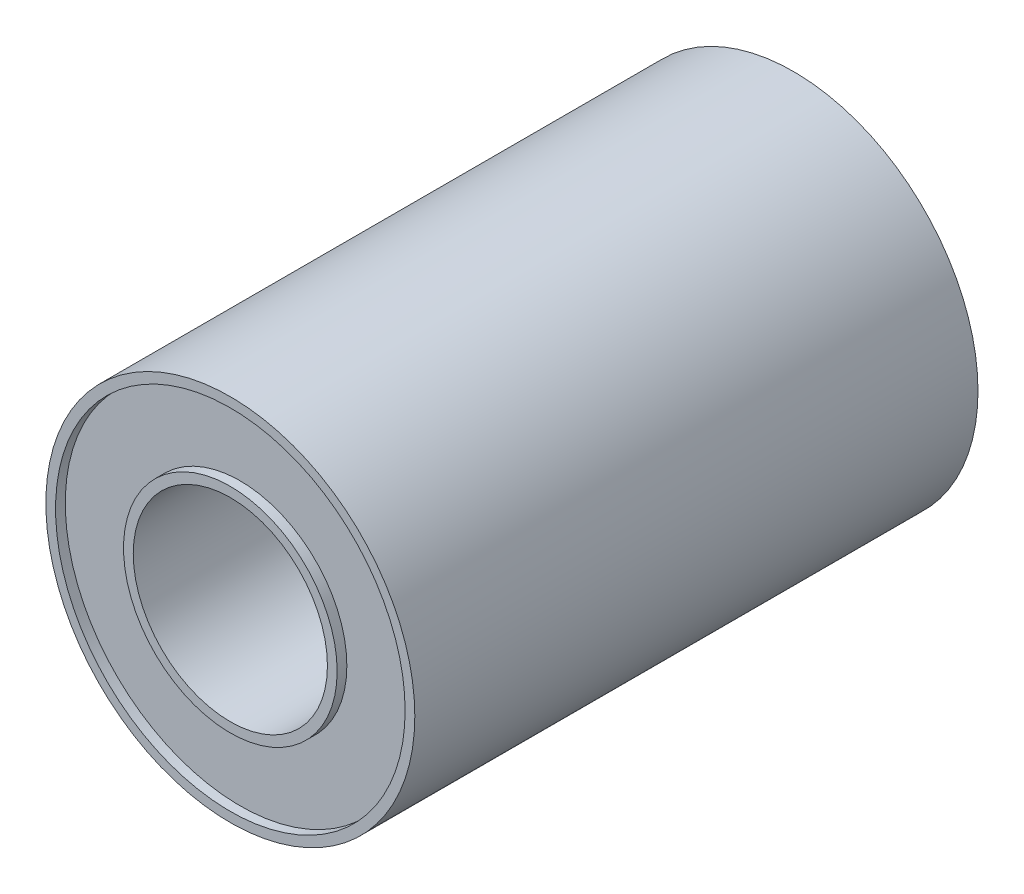
ISO-10303-21;
HEADER;
FILE_DESCRIPTION(('STEP AP214'),'2;1');
FILE_NAME('part.step','',(''),(''),'','','');
FILE_SCHEMA(('AUTOMOTIVE_DESIGN { 1 0 10303 214 1 1 1 1 }'));
ENDSEC;
DATA;
#1=APPLICATION_CONTEXT('core data for automotive mechanical design processes');
#2=APPLICATION_PROTOCOL_DEFINITION('international standard','automotive_design',2000,#1);
#3=PRODUCT_CONTEXT('',#1,'mechanical');
#4=PRODUCT('Part','Part','',(#3));
#5=PRODUCT_RELATED_PRODUCT_CATEGORY('part','',(#4));
#6=PRODUCT_DEFINITION_FORMATION('','',#4);
#7=PRODUCT_DEFINITION_CONTEXT('part definition',#1,'design');
#8=PRODUCT_DEFINITION('design','',#6,#7);
#9=PRODUCT_DEFINITION_SHAPE('','',#8);
#10=(LENGTH_UNIT() NAMED_UNIT(*) SI_UNIT(.MILLI.,.METRE.));
#11=(NAMED_UNIT(*) PLANE_ANGLE_UNIT() SI_UNIT($,.RADIAN.));
#12=(NAMED_UNIT(*) SI_UNIT($,.STERADIAN.) SOLID_ANGLE_UNIT());
#13=UNCERTAINTY_MEASURE_WITH_UNIT(LENGTH_MEASURE(1.E-05),#10,'distance_accuracy_value','');
#14=(GEOMETRIC_REPRESENTATION_CONTEXT(3) GLOBAL_UNCERTAINTY_ASSIGNED_CONTEXT((#13)) GLOBAL_UNIT_ASSIGNED_CONTEXT((#10,
#11,#12)) REPRESENTATION_CONTEXT('',''));
#15=CARTESIAN_POINT('',(0.,0.,0.));
#16=DIRECTION('',(0.,0.,1.));
#17=DIRECTION('',(1.,0.,0.));
#18=AXIS2_PLACEMENT_3D('',#15,#16,#17);
#19=CARTESIAN_POINT('',(0.,0.,-29.));
#20=DIRECTION('',(0.,0.,1.));
#21=DIRECTION('',(1.,0.,0.));
#22=AXIS2_PLACEMENT_3D('',#19,#20,#21);
#23=PLANE('',#22);
#24=CARTESIAN_POINT('',(0.,0.,-29.));
#25=DIRECTION('',(0.,0.,1.));
#26=DIRECTION('',(1.,0.,0.));
#27=AXIS2_PLACEMENT_3D('',#24,#25,#26);
#28=CIRCLE('',#27,5.);
#29=CARTESIAN_POINT('',(5.,0.,-29.));
#30=VERTEX_POINT('',#29);
#31=EDGE_CURVE('E42',#30,#30,#28,.T.);
#32=ORIENTED_EDGE('',*,*,#31,.T.);
#33=EDGE_LOOP('',(#32));
#34=FACE_BOUND('',#33,.T.);
#35=CARTESIAN_POINT('',(0.,0.,-29.));
#36=DIRECTION('',(0.,0.,-1.));
#37=DIRECTION('',(-1.,0.,0.));
#38=AXIS2_PLACEMENT_3D('',#35,#36,#37);
#39=CIRCLE('',#38,5.5);
#40=CARTESIAN_POINT('',(-5.5,0.,-29.));
#41=VERTEX_POINT('',#40);
#42=EDGE_CURVE('E68',#41,#41,#39,.T.);
#43=ORIENTED_EDGE('',*,*,#42,.T.);
#44=EDGE_LOOP('',(#43));
#45=FACE_BOUND('',#44,.T.);
#46=ADVANCED_FACE('F31',(#34,#45),#23,.F.);
#47=CARTESIAN_POINT('',(0.,0.,0.));
#48=DIRECTION('',(0.,0.,1.));
#49=DIRECTION('',(1.,0.,0.));
#50=AXIS2_PLACEMENT_3D('',#47,#48,#49);
#51=PLANE('',#50);
#52=CARTESIAN_POINT('',(0.,0.,0.));
#53=DIRECTION('',(0.,0.,1.));
#54=DIRECTION('',(1.,0.,0.));
#55=AXIS2_PLACEMENT_3D('',#52,#53,#54);
#56=CIRCLE('',#55,5.);
#57=CARTESIAN_POINT('',(5.,0.,0.));
#58=VERTEX_POINT('',#57);
#59=EDGE_CURVE('E44',#58,#58,#56,.T.);
#60=ORIENTED_EDGE('',*,*,#59,.F.);
#61=EDGE_LOOP('',(#60));
#62=FACE_BOUND('',#61,.T.);
#63=CARTESIAN_POINT('',(0.,0.,0.));
#64=DIRECTION('',(0.,0.,1.));
#65=DIRECTION('',(1.,0.,0.));
#66=AXIS2_PLACEMENT_3D('',#63,#64,#65);
#67=CIRCLE('',#66,5.5);
#68=CARTESIAN_POINT('',(5.5,0.,0.));
#69=VERTEX_POINT('',#68);
#70=EDGE_CURVE('E56',#69,#69,#67,.T.);
#71=ORIENTED_EDGE('',*,*,#70,.T.);
#72=EDGE_LOOP('',(#71));
#73=FACE_BOUND('',#72,.T.);
#74=ADVANCED_FACE('F101',(#62,#73),#51,.T.);
#75=CARTESIAN_POINT('',(0.,0.,-29.));
#76=DIRECTION('',(0.,0.,1.));
#77=DIRECTION('',(1.,0.,0.));
#78=AXIS2_PLACEMENT_3D('',#75,#76,#77);
#79=CYLINDRICAL_SURFACE('',#78,9.5);
#80=CARTESIAN_POINT('',(0.,0.,-29.));
#81=DIRECTION('',(0.,0.,1.));
#82=DIRECTION('',(1.,0.,0.));
#83=AXIS2_PLACEMENT_3D('',#80,#81,#82);
#84=CIRCLE('',#83,9.5);
#85=CARTESIAN_POINT('',(9.5,0.,-29.));
#86=VERTEX_POINT('',#85);
#87=EDGE_CURVE('E10',#86,#86,#84,.T.);
#88=ORIENTED_EDGE('',*,*,#87,.T.);
#89=EDGE_LOOP('',(#88));
#90=FACE_BOUND('',#89,.T.);
#91=CARTESIAN_POINT('',(0.,0.,0.));
#92=DIRECTION('',(0.,0.,1.));
#93=DIRECTION('',(1.,0.,0.));
#94=AXIS2_PLACEMENT_3D('',#91,#92,#93);
#95=CIRCLE('',#94,9.5);
#96=CARTESIAN_POINT('',(9.5,0.,0.));
#97=VERTEX_POINT('',#96);
#98=EDGE_CURVE('E35',#97,#97,#95,.T.);
#99=ORIENTED_EDGE('',*,*,#98,.F.);
#100=EDGE_LOOP('',(#99));
#101=FACE_BOUND('',#100,.T.);
#102=ADVANCED_FACE('F33',(#90,#101),#79,.T.);
#103=CARTESIAN_POINT('',(0.,0.,-29.));
#104=DIRECTION('',(0.,0.,-1.));
#105=DIRECTION('',(-1.,0.,0.));
#106=AXIS2_PLACEMENT_3D('',#103,#104,#105);
#107=CIRCLE('',#106,9.);
#108=CARTESIAN_POINT('',(-9.,0.,-29.));
#109=VERTEX_POINT('',#108);
#110=EDGE_CURVE('E62',#109,#109,#107,.T.);
#111=ORIENTED_EDGE('',*,*,#110,.F.);
#112=EDGE_LOOP('',(#111));
#113=FACE_BOUND('',#112,.T.);
#114=ORIENTED_EDGE('',*,*,#87,.F.);
#115=EDGE_LOOP('',(#114));
#116=FACE_BOUND('',#115,.T.);
#117=ADVANCED_FACE('F90',(#113,#116),#23,.F.);
#118=CARTESIAN_POINT('',(0.,0.,0.));
#119=DIRECTION('',(0.,0.,1.));
#120=DIRECTION('',(1.,0.,0.));
#121=AXIS2_PLACEMENT_3D('',#118,#119,#120);
#122=CIRCLE('',#121,9.);
#123=CARTESIAN_POINT('',(9.,0.,0.));
#124=VERTEX_POINT('',#123);
#125=EDGE_CURVE('E50',#124,#124,#122,.T.);
#126=ORIENTED_EDGE('',*,*,#125,.F.);
#127=EDGE_LOOP('',(#126));
#128=FACE_BOUND('',#127,.T.);
#129=ORIENTED_EDGE('',*,*,#98,.T.);
#130=EDGE_LOOP('',(#129));
#131=FACE_BOUND('',#130,.T.);
#132=ADVANCED_FACE('F93',(#128,#131),#51,.T.);
#133=CARTESIAN_POINT('',(0.,0.,-29.));
#134=DIRECTION('',(0.,0.,1.));
#135=DIRECTION('',(1.,0.,0.));
#136=AXIS2_PLACEMENT_3D('',#133,#134,#135);
#137=CYLINDRICAL_SURFACE('',#136,5.);
#138=ORIENTED_EDGE('',*,*,#31,.F.);
#139=EDGE_LOOP('',(#138));
#140=FACE_BOUND('',#139,.T.);
#141=ORIENTED_EDGE('',*,*,#59,.T.);
#142=EDGE_LOOP('',(#141));
#143=FACE_BOUND('',#142,.T.);
#144=ADVANCED_FACE('F99',(#140,#143),#137,.F.);
#145=CARTESIAN_POINT('',(0.,0.,-0.5));
#146=DIRECTION('',(0.,0.,1.));
#147=DIRECTION('',(1.,0.,0.));
#148=AXIS2_PLACEMENT_3D('',#145,#146,#147);
#149=CYLINDRICAL_SURFACE('',#148,9.);
#150=CARTESIAN_POINT('',(0.,0.,-0.5));
#151=DIRECTION('',(0.,0.,1.));
#152=DIRECTION('',(1.,0.,0.));
#153=AXIS2_PLACEMENT_3D('',#150,#151,#152);
#154=CIRCLE('',#153,9.);
#155=CARTESIAN_POINT('',(9.,0.,-0.5));
#156=VERTEX_POINT('',#155);
#157=EDGE_CURVE('E47',#156,#156,#154,.T.);
#158=ORIENTED_EDGE('',*,*,#157,.F.);
#159=EDGE_LOOP('',(#158));
#160=FACE_BOUND('',#159,.T.);
#161=ORIENTED_EDGE('',*,*,#125,.T.);
#162=EDGE_LOOP('',(#161));
#163=FACE_BOUND('',#162,.T.);
#164=ADVANCED_FACE('F123',(#160,#163),#149,.F.);
#165=CARTESIAN_POINT('',(0.,0.,-0.5));
#166=DIRECTION('',(0.,0.,1.));
#167=DIRECTION('',(1.,0.,0.));
#168=AXIS2_PLACEMENT_3D('',#165,#166,#167);
#169=PLANE('',#168);
#170=CARTESIAN_POINT('',(0.,0.,-0.5));
#171=DIRECTION('',(0.,0.,1.));
#172=DIRECTION('',(1.,0.,0.));
#173=AXIS2_PLACEMENT_3D('',#170,#171,#172);
#174=CIRCLE('',#173,5.5);
#175=CARTESIAN_POINT('',(5.5,0.,-0.5));
#176=VERTEX_POINT('',#175);
#177=EDGE_CURVE('E53',#176,#176,#174,.T.);
#178=ORIENTED_EDGE('',*,*,#177,.F.);
#179=EDGE_LOOP('',(#178));
#180=FACE_BOUND('',#179,.T.);
#181=ORIENTED_EDGE('',*,*,#157,.T.);
#182=EDGE_LOOP('',(#181));
#183=FACE_BOUND('',#182,.T.);
#184=ADVANCED_FACE('F119',(#180,#183),#169,.T.);
#185=CARTESIAN_POINT('',(0.,0.,-0.5));
#186=DIRECTION('',(0.,0.,1.));
#187=DIRECTION('',(1.,0.,0.));
#188=AXIS2_PLACEMENT_3D('',#185,#186,#187);
#189=CYLINDRICAL_SURFACE('',#188,5.5);
#190=ORIENTED_EDGE('',*,*,#177,.T.);
#191=EDGE_LOOP('',(#190));
#192=FACE_BOUND('',#191,.T.);
#193=ORIENTED_EDGE('',*,*,#70,.F.);
#194=EDGE_LOOP('',(#193));
#195=FACE_BOUND('',#194,.T.);
#196=ADVANCED_FACE('F86',(#192,#195),#189,.T.);
#197=CARTESIAN_POINT('',(0.,0.,-28.5));
#198=DIRECTION('',(0.,0.,-1.));
#199=DIRECTION('',(-1.,0.,0.));
#200=AXIS2_PLACEMENT_3D('',#197,#198,#199);
#201=CYLINDRICAL_SURFACE('',#200,9.);
#202=CARTESIAN_POINT('',(0.,0.,-28.5));
#203=DIRECTION('',(0.,0.,-1.));
#204=DIRECTION('',(-1.,0.,0.));
#205=AXIS2_PLACEMENT_3D('',#202,#203,#204);
#206=CIRCLE('',#205,9.);
#207=CARTESIAN_POINT('',(-9.,0.,-28.5));
#208=VERTEX_POINT('',#207);
#209=EDGE_CURVE('E59',#208,#208,#206,.T.);
#210=ORIENTED_EDGE('',*,*,#209,.F.);
#211=EDGE_LOOP('',(#210));
#212=FACE_BOUND('',#211,.T.);
#213=ORIENTED_EDGE('',*,*,#110,.T.);
#214=EDGE_LOOP('',(#213));
#215=FACE_BOUND('',#214,.T.);
#216=ADVANCED_FACE('F80',(#212,#215),#201,.F.);
#217=CARTESIAN_POINT('',(0.,0.,-28.5));
#218=DIRECTION('',(0.,0.,-1.));
#219=DIRECTION('',(-1.,0.,0.));
#220=AXIS2_PLACEMENT_3D('',#217,#218,#219);
#221=PLANE('',#220);
#222=CARTESIAN_POINT('',(0.,0.,-28.5));
#223=DIRECTION('',(0.,0.,-1.));
#224=DIRECTION('',(-1.,0.,0.));
#225=AXIS2_PLACEMENT_3D('',#222,#223,#224);
#226=CIRCLE('',#225,5.5);
#227=CARTESIAN_POINT('',(-5.5,0.,-28.5));
#228=VERTEX_POINT('',#227);
#229=EDGE_CURVE('E65',#228,#228,#226,.T.);
#230=ORIENTED_EDGE('',*,*,#229,.F.);
#231=EDGE_LOOP('',(#230));
#232=FACE_BOUND('',#231,.T.);
#233=ORIENTED_EDGE('',*,*,#209,.T.);
#234=EDGE_LOOP('',(#233));
#235=FACE_BOUND('',#234,.T.);
#236=ADVANCED_FACE('F77',(#232,#235),#221,.T.);
#237=CARTESIAN_POINT('',(0.,0.,-28.5));
#238=DIRECTION('',(0.,0.,-1.));
#239=DIRECTION('',(-1.,0.,0.));
#240=AXIS2_PLACEMENT_3D('',#237,#238,#239);
#241=CYLINDRICAL_SURFACE('',#240,5.5);
#242=ORIENTED_EDGE('',*,*,#229,.T.);
#243=EDGE_LOOP('',(#242));
#244=FACE_BOUND('',#243,.T.);
#245=ORIENTED_EDGE('',*,*,#42,.F.);
#246=EDGE_LOOP('',(#245));
#247=FACE_BOUND('',#246,.T.);
#248=ADVANCED_FACE('F74',(#244,#247),#241,.T.);
#249=CLOSED_SHELL('',(#46,#74,#102,#117,#132,#144,#164,#184,#196,#216,#236,#248));
#250=MANIFOLD_SOLID_BREP('B2',#249);
#251=ADVANCED_BREP_SHAPE_REPRESENTATION('',(#18,#250),#14);
#252=SHAPE_DEFINITION_REPRESENTATION(#9,#251);
ENDSEC;
END-ISO-10303-21;
